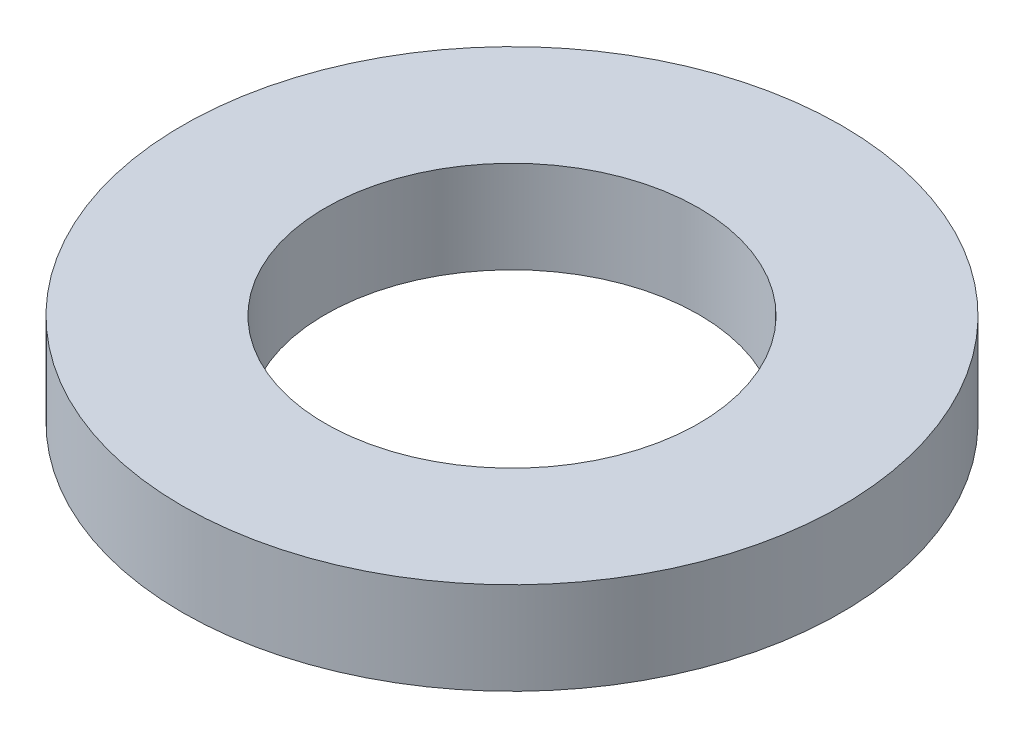
ISO-10303-21;
HEADER;
FILE_DESCRIPTION(('STEP AP214'),'2;1');
FILE_NAME('part.step','',(''),(''),'','','');
FILE_SCHEMA(('AUTOMOTIVE_DESIGN { 1 0 10303 214 1 1 1 1 }'));
ENDSEC;
DATA;
#1=APPLICATION_CONTEXT('core data for automotive mechanical design processes');
#2=APPLICATION_PROTOCOL_DEFINITION('international standard','automotive_design',2000,#1);
#3=PRODUCT_CONTEXT('',#1,'mechanical');
#4=PRODUCT('Part','Part','',(#3));
#5=PRODUCT_RELATED_PRODUCT_CATEGORY('part','',(#4));
#6=PRODUCT_DEFINITION_FORMATION('','',#4);
#7=PRODUCT_DEFINITION_CONTEXT('part definition',#1,'design');
#8=PRODUCT_DEFINITION('design','',#6,#7);
#9=PRODUCT_DEFINITION_SHAPE('','',#8);
#10=(LENGTH_UNIT() NAMED_UNIT(*) SI_UNIT(.MILLI.,.METRE.));
#11=(NAMED_UNIT(*) PLANE_ANGLE_UNIT() SI_UNIT($,.RADIAN.));
#12=(NAMED_UNIT(*) SI_UNIT($,.STERADIAN.) SOLID_ANGLE_UNIT());
#13=UNCERTAINTY_MEASURE_WITH_UNIT(LENGTH_MEASURE(1.E-05),#10,'distance_accuracy_value','');
#14=(GEOMETRIC_REPRESENTATION_CONTEXT(3) GLOBAL_UNCERTAINTY_ASSIGNED_CONTEXT((#13)) GLOBAL_UNIT_ASSIGNED_CONTEXT((#10,
#11,#12)) REPRESENTATION_CONTEXT('',''));
#15=CARTESIAN_POINT('',(0.,0.,0.));
#16=DIRECTION('',(0.,0.,1.));
#17=DIRECTION('',(1.,0.,0.));
#18=AXIS2_PLACEMENT_3D('',#15,#16,#17);
#19=CARTESIAN_POINT('',(0.,21.,0.));
#20=DIRECTION('',(0.,-1.,0.));
#21=DIRECTION('',(0.,0.,-1.));
#22=AXIS2_PLACEMENT_3D('',#19,#20,#21);
#23=CYLINDRICAL_SURFACE('',#22,75.);
#24=CARTESIAN_POINT('',(0.,21.,0.));
#25=DIRECTION('',(0.,1.,0.));
#26=DIRECTION('',(0.,0.,1.));
#27=AXIS2_PLACEMENT_3D('',#24,#25,#26);
#28=CIRCLE('',#27,75.);
#29=CARTESIAN_POINT('',(0.,21.,-75.));
#30=VERTEX_POINT('',#29);
#31=EDGE_CURVE('E10',#30,#30,#28,.T.);
#32=CARTESIAN_POINT('',(0.,0.,0.));
#33=DIRECTION('',(0.,1.,0.));
#34=DIRECTION('',(0.,0.,1.));
#35=AXIS2_PLACEMENT_3D('',#32,#33,#34);
#36=CIRCLE('',#35,75.);
#37=CARTESIAN_POINT('',(0.,0.,-75.));
#38=VERTEX_POINT('',#37);
#39=EDGE_CURVE('E37',#38,#38,#36,.T.);
#40=CARTESIAN_POINT('',(0.,21.,-75.));
#41=CARTESIAN_POINT('',(0.,20.78125,-75.));
#42=CARTESIAN_POINT('',(0.,20.5625,-75.));
#43=CARTESIAN_POINT('',(0.,20.125,-75.));
#44=CARTESIAN_POINT('',(0.,19.90625,-75.));
#45=CARTESIAN_POINT('',(0.,19.46875,-75.));
#46=CARTESIAN_POINT('',(0.,19.25,-75.));
#47=CARTESIAN_POINT('',(0.,18.8125,-75.));
#48=CARTESIAN_POINT('',(0.,18.59375,-75.));
#49=CARTESIAN_POINT('',(0.,18.15625,-75.));
#50=CARTESIAN_POINT('',(0.,17.9375,-75.));
#51=CARTESIAN_POINT('',(0.,17.5,-75.));
#52=CARTESIAN_POINT('',(0.,17.28125,-75.));
#53=CARTESIAN_POINT('',(0.,16.84375,-75.));
#54=CARTESIAN_POINT('',(0.,16.625,-75.));
#55=CARTESIAN_POINT('',(0.,16.1875,-75.));
#56=CARTESIAN_POINT('',(0.,15.96875,-75.));
#57=CARTESIAN_POINT('',(0.,15.53125,-75.));
#58=CARTESIAN_POINT('',(0.,15.3125,-75.));
#59=CARTESIAN_POINT('',(0.,14.875,-75.));
#60=CARTESIAN_POINT('',(0.,14.65625,-75.));
#61=CARTESIAN_POINT('',(0.,14.21875,-75.));
#62=CARTESIAN_POINT('',(0.,14.,-75.));
#63=CARTESIAN_POINT('',(0.,13.5625,-75.));
#64=CARTESIAN_POINT('',(0.,13.34375,-75.));
#65=CARTESIAN_POINT('',(0.,12.90625,-75.));
#66=CARTESIAN_POINT('',(0.,12.6875,-75.));
#67=CARTESIAN_POINT('',(0.,12.25,-75.));
#68=CARTESIAN_POINT('',(0.,12.03125,-75.));
#69=CARTESIAN_POINT('',(0.,11.59375,-75.));
#70=CARTESIAN_POINT('',(0.,11.375,-75.));
#71=CARTESIAN_POINT('',(0.,10.9375,-75.));
#72=CARTESIAN_POINT('',(0.,10.71875,-75.));
#73=CARTESIAN_POINT('',(0.,10.28125,-75.));
#74=CARTESIAN_POINT('',(0.,10.0625,-75.));
#75=CARTESIAN_POINT('',(0.,9.625,-75.));
#76=CARTESIAN_POINT('',(0.,9.40625,-75.));
#77=CARTESIAN_POINT('',(0.,8.96875,-75.));
#78=CARTESIAN_POINT('',(0.,8.75,-75.));
#79=CARTESIAN_POINT('',(0.,8.3125,-75.));
#80=CARTESIAN_POINT('',(0.,8.09375,-75.));
#81=CARTESIAN_POINT('',(0.,7.65625,-75.));
#82=CARTESIAN_POINT('',(0.,7.4375,-75.));
#83=CARTESIAN_POINT('',(0.,7.,-75.));
#84=CARTESIAN_POINT('',(0.,6.78125,-75.));
#85=CARTESIAN_POINT('',(0.,6.34375,-75.));
#86=CARTESIAN_POINT('',(0.,6.125,-75.));
#87=CARTESIAN_POINT('',(0.,5.6875,-75.));
#88=CARTESIAN_POINT('',(0.,5.46875,-75.));
#89=CARTESIAN_POINT('',(0.,5.03125,-75.));
#90=CARTESIAN_POINT('',(0.,4.8125,-75.));
#91=CARTESIAN_POINT('',(0.,4.375,-75.));
#92=CARTESIAN_POINT('',(0.,4.15625,-75.));
#93=CARTESIAN_POINT('',(0.,3.71875,-75.));
#94=CARTESIAN_POINT('',(0.,3.5,-75.));
#95=CARTESIAN_POINT('',(0.,3.0625,-75.));
#96=CARTESIAN_POINT('',(0.,2.84375,-75.));
#97=CARTESIAN_POINT('',(0.,2.40625,-75.));
#98=CARTESIAN_POINT('',(0.,2.1875,-75.));
#99=CARTESIAN_POINT('',(0.,1.75,-75.));
#100=CARTESIAN_POINT('',(0.,1.53125,-75.));
#101=CARTESIAN_POINT('',(0.,1.09375,-75.));
#102=CARTESIAN_POINT('',(0.,0.875000000000001,-75.));
#103=CARTESIAN_POINT('',(0.,0.4375,-75.));
#104=CARTESIAN_POINT('',(0.,0.21875,-75.));
#105=CARTESIAN_POINT('',(0.,0.,-75.));
#106=B_SPLINE_CURVE_WITH_KNOTS('',3,(#40,#41,#42,#43,#44,#45,#46,#47,#48,#49,#50,#51,#52,#53,
#54,#55,#56,#57,#58,#59,#60,#61,#62,#63,#64,#65,#66,#67,#68,#69,#70,#71,#72,#73,#74,#75,#76,#77,
#78,#79,#80,#81,#82,#83,#84,#85,#86,#87,#88,#89,#90,#91,#92,#93,#94,#95,#96,#97,#98,#99,#100,
#101,#102,#103,#104,#105),.UNSPECIFIED.,.F.,.F.,(4,2,2,2,2,2,2,2,2,2,2,2,2,2,2,2,2,2,2,2,2,2,2,
2,2,2,2,2,2,2,2,2,4),(0.,0.656250000000001,1.3125,1.96875,2.625,3.28125,3.9375,4.59375,5.25,
5.90625,6.5625,7.21875,7.875,8.53125,9.1875,9.84375,10.5,11.15625,11.8125,12.46875,13.125,
13.78125,14.4375,15.09375,15.75,16.40625,17.0625,17.71875,18.375,19.03125,19.6875,20.34375,21.),.UNSPECIFIED.);
#107=EDGE_CURVE('BSEAM40',#30,#38,#106,.T.);
#108=ORIENTED_EDGE('',*,*,#31,.F.);
#109=ORIENTED_EDGE('',*,*,#39,.T.);
#110=ORIENTED_EDGE('',*,*,#107,.T.);
#111=ORIENTED_EDGE('',*,*,#107,.F.);
#112=EDGE_LOOP('',(#108,#110,#109,#111));
#113=FACE_BOUND('',#112,.T.);
#114=ADVANCED_FACE('F40',(#113),#23,.T.);
#115=CARTESIAN_POINT('',(0.,21.,0.));
#116=DIRECTION('',(0.,1.,0.));
#117=DIRECTION('',(0.,0.,1.));
#118=AXIS2_PLACEMENT_3D('',#115,#116,#117);
#119=PLANE('',#118);
#120=CARTESIAN_POINT('',(0.,21.,0.));
#121=DIRECTION('',(0.,1.,0.));
#122=DIRECTION('',(0.,0.,1.));
#123=AXIS2_PLACEMENT_3D('',#120,#121,#122);
#124=CIRCLE('',#123,42.5);
#125=CARTESIAN_POINT('',(0.,21.,-42.5));
#126=VERTEX_POINT('',#125);
#127=EDGE_CURVE('E50',#126,#126,#124,.T.);
#128=ORIENTED_EDGE('',*,*,#127,.F.);
#129=EDGE_LOOP('',(#128));
#130=FACE_BOUND('',#129,.T.);
#131=ORIENTED_EDGE('',*,*,#31,.T.);
#132=EDGE_LOOP('',(#131));
#133=FACE_BOUND('',#132,.T.);
#134=ADVANCED_FACE('F59',(#130,#133),#119,.T.);
#135=CARTESIAN_POINT('',(0.,0.,0.));
#136=DIRECTION('',(0.,1.,0.));
#137=DIRECTION('',(0.,0.,1.));
#138=AXIS2_PLACEMENT_3D('',#135,#136,#137);
#139=PLANE('',#138);
#140=CARTESIAN_POINT('',(0.,0.,0.));
#141=DIRECTION('',(0.,1.,0.));
#142=DIRECTION('',(0.,0.,1.));
#143=AXIS2_PLACEMENT_3D('',#140,#141,#142);
#144=CIRCLE('',#143,42.5);
#145=CARTESIAN_POINT('',(0.,0.,-42.5));
#146=VERTEX_POINT('',#145);
#147=EDGE_CURVE('E47',#146,#146,#144,.T.);
#148=ORIENTED_EDGE('',*,*,#147,.T.);
#149=EDGE_LOOP('',(#148));
#150=FACE_BOUND('',#149,.T.);
#151=ORIENTED_EDGE('',*,*,#39,.F.);
#152=EDGE_LOOP('',(#151));
#153=FACE_BOUND('',#152,.T.);
#154=ADVANCED_FACE('F58',(#150,#153),#139,.F.);
#155=CARTESIAN_POINT('',(0.,21.,0.));
#156=DIRECTION('',(0.,-1.,0.));
#157=DIRECTION('',(0.,0.,-1.));
#158=AXIS2_PLACEMENT_3D('',#155,#156,#157);
#159=CYLINDRICAL_SURFACE('',#158,42.5);
#160=CARTESIAN_POINT('',(0.,21.,-42.5));
#161=CARTESIAN_POINT('',(0.,20.78125,-42.5));
#162=CARTESIAN_POINT('',(0.,20.5625,-42.5));
#163=CARTESIAN_POINT('',(0.,20.125,-42.5));
#164=CARTESIAN_POINT('',(0.,19.90625,-42.5));
#165=CARTESIAN_POINT('',(0.,19.46875,-42.5));
#166=CARTESIAN_POINT('',(0.,19.25,-42.5));
#167=CARTESIAN_POINT('',(0.,18.8125,-42.5));
#168=CARTESIAN_POINT('',(0.,18.59375,-42.5));
#169=CARTESIAN_POINT('',(0.,18.15625,-42.5));
#170=CARTESIAN_POINT('',(0.,17.9375,-42.5));
#171=CARTESIAN_POINT('',(0.,17.5,-42.5));
#172=CARTESIAN_POINT('',(0.,17.28125,-42.5));
#173=CARTESIAN_POINT('',(0.,16.84375,-42.5));
#174=CARTESIAN_POINT('',(0.,16.625,-42.5));
#175=CARTESIAN_POINT('',(0.,16.1875,-42.5));
#176=CARTESIAN_POINT('',(0.,15.96875,-42.5));
#177=CARTESIAN_POINT('',(0.,15.53125,-42.5));
#178=CARTESIAN_POINT('',(0.,15.3125,-42.5));
#179=CARTESIAN_POINT('',(0.,14.875,-42.5));
#180=CARTESIAN_POINT('',(0.,14.65625,-42.5));
#181=CARTESIAN_POINT('',(0.,14.21875,-42.5));
#182=CARTESIAN_POINT('',(0.,14.,-42.5));
#183=CARTESIAN_POINT('',(0.,13.5625,-42.5));
#184=CARTESIAN_POINT('',(0.,13.34375,-42.5));
#185=CARTESIAN_POINT('',(0.,12.90625,-42.5));
#186=CARTESIAN_POINT('',(0.,12.6875,-42.5));
#187=CARTESIAN_POINT('',(0.,12.25,-42.5));
#188=CARTESIAN_POINT('',(0.,12.03125,-42.5));
#189=CARTESIAN_POINT('',(0.,11.59375,-42.5));
#190=CARTESIAN_POINT('',(0.,11.375,-42.5));
#191=CARTESIAN_POINT('',(0.,10.9375,-42.5));
#192=CARTESIAN_POINT('',(0.,10.71875,-42.5));
#193=CARTESIAN_POINT('',(0.,10.28125,-42.5));
#194=CARTESIAN_POINT('',(0.,10.0625,-42.5));
#195=CARTESIAN_POINT('',(0.,9.625,-42.5));
#196=CARTESIAN_POINT('',(0.,9.40625,-42.5));
#197=CARTESIAN_POINT('',(0.,8.96875,-42.5));
#198=CARTESIAN_POINT('',(0.,8.75,-42.5));
#199=CARTESIAN_POINT('',(0.,8.3125,-42.5));
#200=CARTESIAN_POINT('',(0.,8.09375,-42.5));
#201=CARTESIAN_POINT('',(0.,7.65625,-42.5));
#202=CARTESIAN_POINT('',(0.,7.4375,-42.5));
#203=CARTESIAN_POINT('',(0.,7.,-42.5));
#204=CARTESIAN_POINT('',(0.,6.78125,-42.5));
#205=CARTESIAN_POINT('',(0.,6.34375,-42.5));
#206=CARTESIAN_POINT('',(0.,6.125,-42.5));
#207=CARTESIAN_POINT('',(0.,5.6875,-42.5));
#208=CARTESIAN_POINT('',(0.,5.46875,-42.5));
#209=CARTESIAN_POINT('',(0.,5.03125,-42.5));
#210=CARTESIAN_POINT('',(0.,4.8125,-42.5));
#211=CARTESIAN_POINT('',(0.,4.375,-42.5));
#212=CARTESIAN_POINT('',(0.,4.15625,-42.5));
#213=CARTESIAN_POINT('',(0.,3.71875,-42.5));
#214=CARTESIAN_POINT('',(0.,3.5,-42.5));
#215=CARTESIAN_POINT('',(0.,3.0625,-42.5));
#216=CARTESIAN_POINT('',(0.,2.84375,-42.5));
#217=CARTESIAN_POINT('',(0.,2.40625,-42.5));
#218=CARTESIAN_POINT('',(0.,2.1875,-42.5));
#219=CARTESIAN_POINT('',(0.,1.75,-42.5));
#220=CARTESIAN_POINT('',(0.,1.53125,-42.5));
#221=CARTESIAN_POINT('',(0.,1.09375,-42.5));
#222=CARTESIAN_POINT('',(0.,0.875000000000001,-42.5));
#223=CARTESIAN_POINT('',(0.,0.4375,-42.5));
#224=CARTESIAN_POINT('',(0.,0.21875,-42.5));
#225=CARTESIAN_POINT('',(0.,0.,-42.5));
#226=B_SPLINE_CURVE_WITH_KNOTS('',3,(#160,#161,#162,#163,#164,#165,#166,#167,#168,#169,#170,
#171,#172,#173,#174,#175,#176,#177,#178,#179,#180,#181,#182,#183,#184,#185,#186,#187,#188,#189,
#190,#191,#192,#193,#194,#195,#196,#197,#198,#199,#200,#201,#202,#203,#204,#205,#206,#207,#208,
#209,#210,#211,#212,#213,#214,#215,#216,#217,#218,#219,#220,#221,#222,#223,#224,#225),
.UNSPECIFIED.,.F.,.F.,(4,2,2,2,2,2,2,2,2,2,2,2,2,2,2,2,2,2,2,2,2,2,2,2,2,2,2,2,2,2,2,2,4),(0.,
0.656249999999997,1.3125,1.96875,2.625,3.28125,3.9375,4.59375,5.25,5.90625,6.5625,7.21875,7.875,
8.53125,9.1875,9.84375,10.5,11.15625,11.8125,12.46875,13.125,13.78125,14.4375,15.09375,15.75,
16.40625,17.0625,17.71875,18.375,19.03125,19.6875,20.34375,21.),.UNSPECIFIED.);
#227=EDGE_CURVE('BSEAM54',#126,#146,#226,.T.);
#228=ORIENTED_EDGE('',*,*,#127,.T.);
#229=ORIENTED_EDGE('',*,*,#147,.F.);
#230=ORIENTED_EDGE('',*,*,#227,.T.);
#231=ORIENTED_EDGE('',*,*,#227,.F.);
#232=EDGE_LOOP('',(#228,#230,#229,#231));
#233=FACE_BOUND('',#232,.T.);
#234=ADVANCED_FACE('F54',(#233),#159,.F.);
#235=CLOSED_SHELL('',(#114,#134,#154,#234));
#236=MANIFOLD_SOLID_BREP('B2',#235);
#237=ADVANCED_BREP_SHAPE_REPRESENTATION('',(#18,#236),#14);
#238=SHAPE_DEFINITION_REPRESENTATION(#9,#237);
ENDSEC;
END-ISO-10303-21;
